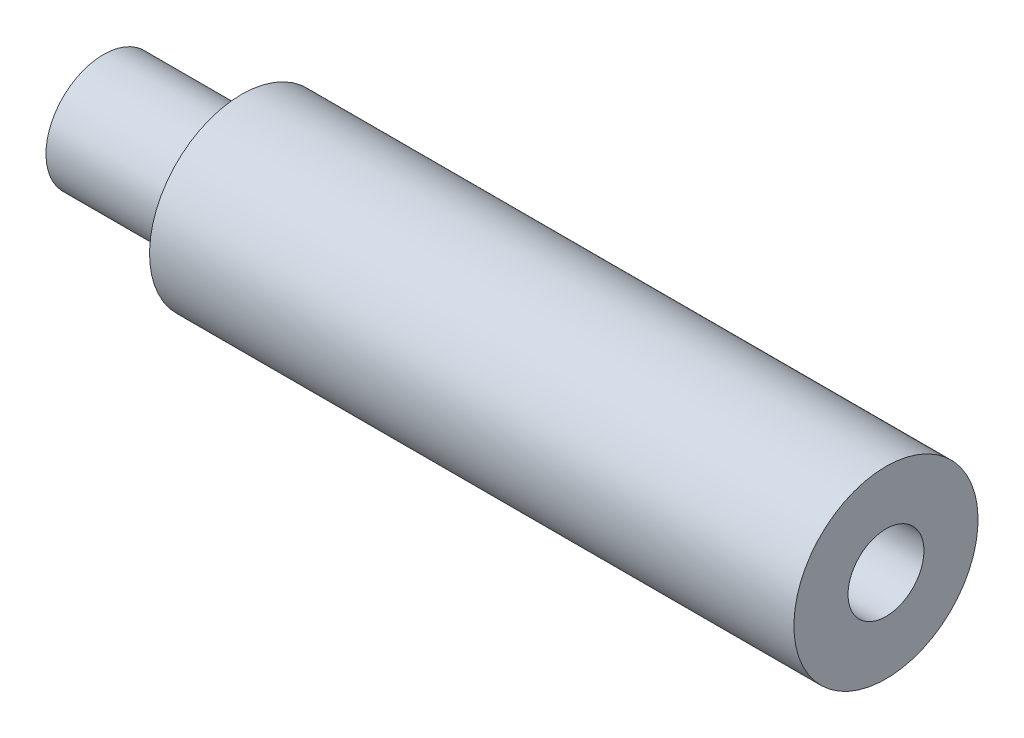
ISO-10303-21;
HEADER;
FILE_DESCRIPTION(('STEP AP214'),'2;1');
FILE_NAME('part.step','',(''),(''),'','','');
FILE_SCHEMA(('AUTOMOTIVE_DESIGN { 1 0 10303 214 1 1 1 1 }'));
ENDSEC;
DATA;
#1=APPLICATION_CONTEXT('core data for automotive mechanical design processes');
#2=APPLICATION_PROTOCOL_DEFINITION('international standard','automotive_design',2000,#1);
#3=PRODUCT_CONTEXT('',#1,'mechanical');
#4=PRODUCT('Part','Part','',(#3));
#5=PRODUCT_RELATED_PRODUCT_CATEGORY('part','',(#4));
#6=PRODUCT_DEFINITION_FORMATION('','',#4);
#7=PRODUCT_DEFINITION_CONTEXT('part definition',#1,'design');
#8=PRODUCT_DEFINITION('design','',#6,#7);
#9=PRODUCT_DEFINITION_SHAPE('','',#8);
#10=(LENGTH_UNIT() NAMED_UNIT(*) SI_UNIT(.MILLI.,.METRE.));
#11=(NAMED_UNIT(*) PLANE_ANGLE_UNIT() SI_UNIT($,.RADIAN.));
#12=(NAMED_UNIT(*) SI_UNIT($,.STERADIAN.) SOLID_ANGLE_UNIT());
#13=UNCERTAINTY_MEASURE_WITH_UNIT(LENGTH_MEASURE(1.E-05),#10,'distance_accuracy_value','');
#14=(GEOMETRIC_REPRESENTATION_CONTEXT(3) GLOBAL_UNCERTAINTY_ASSIGNED_CONTEXT((#13)) GLOBAL_UNIT_ASSIGNED_CONTEXT((#10,
#11,#12)) REPRESENTATION_CONTEXT('',''));
#15=CARTESIAN_POINT('',(0.,0.,0.));
#16=DIRECTION('',(0.,0.,1.));
#17=DIRECTION('',(1.,0.,0.));
#18=AXIS2_PLACEMENT_3D('',#15,#16,#17);
#19=CARTESIAN_POINT('',(0.,0.,0.));
#20=DIRECTION('',(-1.,0.,0.));
#21=DIRECTION('',(0.,-1.,0.));
#22=AXIS2_PLACEMENT_3D('',#19,#20,#21);
#23=PLANE('',#22);
#24=CARTESIAN_POINT('',(0.,0.,0.));
#25=DIRECTION('',(1.,0.,0.));
#26=DIRECTION('',(0.,1.,0.));
#27=AXIS2_PLACEMENT_3D('',#24,#25,#26);
#28=CIRCLE('',#27,2.5);
#29=CARTESIAN_POINT('',(0.,2.5,0.));
#30=VERTEX_POINT('',#29);
#31=EDGE_CURVE('E11',#30,#30,#28,.T.);
#32=ORIENTED_EDGE('',*,*,#31,.F.);
#33=EDGE_LOOP('',(#32));
#34=FACE_BOUND('',#33,.T.);
#35=ADVANCED_FACE('F36',(#34),#23,.T.);
#36=CARTESIAN_POINT('',(34.,0.,0.));
#37=DIRECTION('',(1.,0.,0.));
#38=DIRECTION('',(0.,1.,0.));
#39=AXIS2_PLACEMENT_3D('',#36,#37,#38);
#40=CYLINDRICAL_SURFACE('',#39,2.5);
#41=ORIENTED_EDGE('',*,*,#31,.T.);
#42=EDGE_LOOP('',(#41));
#43=FACE_BOUND('',#42,.T.);
#44=CARTESIAN_POINT('',(6.,0.,0.));
#45=DIRECTION('',(1.,0.,0.));
#46=DIRECTION('',(0.,1.,0.));
#47=AXIS2_PLACEMENT_3D('',#44,#45,#46);
#48=CIRCLE('',#47,2.5);
#49=CARTESIAN_POINT('',(6.,2.5,0.));
#50=VERTEX_POINT('',#49);
#51=EDGE_CURVE('E42',#50,#50,#48,.T.);
#52=ORIENTED_EDGE('',*,*,#51,.F.);
#53=EDGE_LOOP('',(#52));
#54=FACE_BOUND('',#53,.T.);
#55=ADVANCED_FACE('F71',(#43,#54),#40,.T.);
#56=CARTESIAN_POINT('',(6.,2.5,0.));
#57=DIRECTION('',(-1.,0.,0.));
#58=DIRECTION('',(0.,-1.,0.));
#59=AXIS2_PLACEMENT_3D('',#56,#57,#58);
#60=PLANE('',#59);
#61=ORIENTED_EDGE('',*,*,#51,.T.);
#62=EDGE_LOOP('',(#61));
#63=FACE_BOUND('',#62,.T.);
#64=CARTESIAN_POINT('',(6.,0.,0.));
#65=DIRECTION('',(1.,0.,0.));
#66=DIRECTION('',(0.,1.,0.));
#67=AXIS2_PLACEMENT_3D('',#64,#65,#66);
#68=CIRCLE('',#67,4.);
#69=CARTESIAN_POINT('',(6.,4.,0.));
#70=VERTEX_POINT('',#69);
#71=EDGE_CURVE('E63',#70,#70,#68,.T.);
#72=ORIENTED_EDGE('',*,*,#71,.F.);
#73=EDGE_LOOP('',(#72));
#74=FACE_BOUND('',#73,.T.);
#75=ADVANCED_FACE('F68',(#63,#74),#60,.T.);
#76=CARTESIAN_POINT('',(34.,0.,0.));
#77=DIRECTION('',(1.,0.,0.));
#78=DIRECTION('',(0.,1.,0.));
#79=AXIS2_PLACEMENT_3D('',#76,#77,#78);
#80=CYLINDRICAL_SURFACE('',#79,4.);
#81=ORIENTED_EDGE('',*,*,#71,.T.);
#82=EDGE_LOOP('',(#81));
#83=FACE_BOUND('',#82,.T.);
#84=CARTESIAN_POINT('',(34.,0.,0.));
#85=DIRECTION('',(1.,0.,0.));
#86=DIRECTION('',(0.,1.,0.));
#87=AXIS2_PLACEMENT_3D('',#84,#85,#86);
#88=CIRCLE('',#87,4.);
#89=CARTESIAN_POINT('',(34.,4.,0.));
#90=VERTEX_POINT('',#89);
#91=EDGE_CURVE('E57',#90,#90,#88,.T.);
#92=ORIENTED_EDGE('',*,*,#91,.F.);
#93=EDGE_LOOP('',(#92));
#94=FACE_BOUND('',#93,.T.);
#95=ADVANCED_FACE('F78',(#83,#94),#80,.T.);
#96=CARTESIAN_POINT('',(34.,4.,0.));
#97=DIRECTION('',(1.,0.,0.));
#98=DIRECTION('',(0.,1.,0.));
#99=AXIS2_PLACEMENT_3D('',#96,#97,#98);
#100=PLANE('',#99);
#101=CARTESIAN_POINT('',(34.,0.,0.));
#102=DIRECTION('',(1.,0.,0.));
#103=DIRECTION('',(0.,0.,-1.));
#104=AXIS2_PLACEMENT_3D('',#101,#102,#103);
#105=CIRCLE('',#104,1.64999999999999);
#106=CARTESIAN_POINT('',(34.,0.,-1.64999999999999));
#107=VERTEX_POINT('',#106);
#108=EDGE_CURVE('E54',#107,#107,#105,.T.);
#109=ORIENTED_EDGE('',*,*,#108,.F.);
#110=EDGE_LOOP('',(#109));
#111=FACE_BOUND('',#110,.T.);
#112=ORIENTED_EDGE('',*,*,#91,.T.);
#113=EDGE_LOOP('',(#112));
#114=FACE_BOUND('',#113,.T.);
#115=ADVANCED_FACE('F84',(#111,#114),#100,.T.);
#116=CARTESIAN_POINT('',(34.,0.,0.));
#117=DIRECTION('',(1.,0.,0.));
#118=DIRECTION('',(0.,0.,-1.));
#119=AXIS2_PLACEMENT_3D('',#116,#117,#118);
#120=CYLINDRICAL_SURFACE('',#119,1.64999999999999);
#121=CARTESIAN_POINT('',(9.,0.,0.));
#122=DIRECTION('',(1.,0.,0.));
#123=DIRECTION('',(0.,0.,-1.));
#124=AXIS2_PLACEMENT_3D('',#121,#122,#123);
#125=CIRCLE('',#124,1.65);
#126=CARTESIAN_POINT('',(9.,0.,-1.65));
#127=VERTEX_POINT('',#126);
#128=EDGE_CURVE('E52',#127,#127,#125,.T.);
#129=ORIENTED_EDGE('',*,*,#128,.F.);
#130=EDGE_LOOP('',(#129));
#131=FACE_BOUND('',#130,.T.);
#132=ORIENTED_EDGE('',*,*,#108,.T.);
#133=EDGE_LOOP('',(#132));
#134=FACE_BOUND('',#133,.T.);
#135=ADVANCED_FACE('F48',(#131,#134),#120,.F.);
#136=CARTESIAN_POINT('',(9.,0.,0.));
#137=DIRECTION('',(1.,0.,0.));
#138=DIRECTION('',(0.,0.,-1.));
#139=AXIS2_PLACEMENT_3D('',#136,#137,#138);
#140=CONICAL_SURFACE('',#139,1.65,1.02974425867665);
#141=CARTESIAN_POINT('',(8.00857997860453,0.,0.));
#142=VERTEX_POINT('',#141);
#143=VERTEX_LOOP('',#142);
#144=FACE_BOUND('',#143,.T.);
#145=ORIENTED_EDGE('',*,*,#128,.T.);
#146=EDGE_LOOP('',(#145));
#147=FACE_BOUND('',#146,.T.);
#148=ADVANCED_FACE('F45',(#144,#147),#140,.F.);
#149=CLOSED_SHELL('',(#35,#55,#75,#95,#115,#135,#148));
#150=MANIFOLD_SOLID_BREP('B2',#149);
#151=ADVANCED_BREP_SHAPE_REPRESENTATION('',(#18,#150),#14);
#152=SHAPE_DEFINITION_REPRESENTATION(#9,#151);
ENDSEC;
END-ISO-10303-21;
